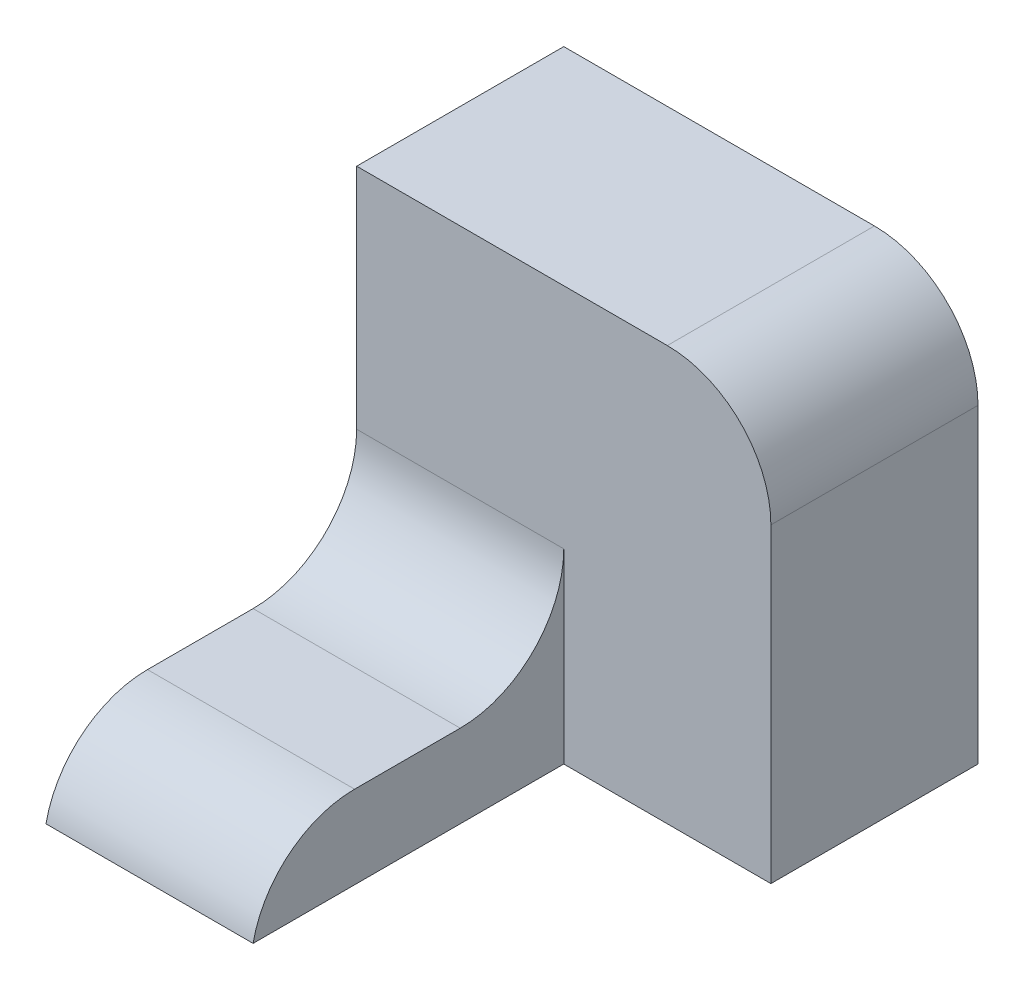
ISO-10303-21;
HEADER;
FILE_DESCRIPTION(('STEP AP214'),'2;1');
FILE_NAME('part.step','',(''),(''),'','','');
FILE_SCHEMA(('AUTOMOTIVE_DESIGN { 1 0 10303 214 1 1 1 1 }'));
ENDSEC;
DATA;
#1=APPLICATION_CONTEXT('core data for automotive mechanical design processes');
#2=APPLICATION_PROTOCOL_DEFINITION('international standard','automotive_design',2000,#1);
#3=PRODUCT_CONTEXT('',#1,'mechanical');
#4=PRODUCT('Part','Part','',(#3));
#5=PRODUCT_RELATED_PRODUCT_CATEGORY('part','',(#4));
#6=PRODUCT_DEFINITION_FORMATION('','',#4);
#7=PRODUCT_DEFINITION_CONTEXT('part definition',#1,'design');
#8=PRODUCT_DEFINITION('design','',#6,#7);
#9=PRODUCT_DEFINITION_SHAPE('','',#8);
#10=(LENGTH_UNIT() NAMED_UNIT(*) SI_UNIT(.MILLI.,.METRE.));
#11=(NAMED_UNIT(*) PLANE_ANGLE_UNIT() SI_UNIT($,.RADIAN.));
#12=(NAMED_UNIT(*) SI_UNIT($,.STERADIAN.) SOLID_ANGLE_UNIT());
#13=UNCERTAINTY_MEASURE_WITH_UNIT(LENGTH_MEASURE(1.E-05),#10,'distance_accuracy_value','');
#14=(GEOMETRIC_REPRESENTATION_CONTEXT(3) GLOBAL_UNCERTAINTY_ASSIGNED_CONTEXT((#13)) GLOBAL_UNIT_ASSIGNED_CONTEXT((#10,
#11,#12)) REPRESENTATION_CONTEXT('',''));
#15=CARTESIAN_POINT('',(0.,0.,0.));
#16=DIRECTION('',(0.,0.,1.));
#17=DIRECTION('',(1.,0.,0.));
#18=AXIS2_PLACEMENT_3D('',#15,#16,#17);
#19=CARTESIAN_POINT('',(-10.,0.,30.));
#20=DIRECTION('',(0.,-1.,0.));
#21=DIRECTION('',(1.,0.,0.));
#22=AXIS2_PLACEMENT_3D('',#19,#20,#21);
#23=PLANE('',#22);
#24=DIRECTION('',(0.,0.,-1.));
#25=VECTOR('',#24,1.);
#26=CARTESIAN_POINT('',(-10.,0.,30.));
#27=LINE('',#26,#25);
#28=CARTESIAN_POINT('',(-10.,0.,20.2020410288673));
#29=VERTEX_POINT('',#28);
#30=CARTESIAN_POINT('',(-10.,0.,10.));
#31=VERTEX_POINT('',#30);
#32=EDGE_CURVE('E144',#29,#31,#27,.T.);
#33=ORIENTED_EDGE('',*,*,#32,.T.);
#34=DIRECTION('',(-1.,0.,0.));
#35=VECTOR('',#34,1.);
#36=CARTESIAN_POINT('',(-10.,0.,10.));
#37=LINE('',#36,#35);
#38=CARTESIAN_POINT('',(-30.,0.,10.));
#39=VERTEX_POINT('',#38);
#40=EDGE_CURVE('E158',#31,#39,#37,.T.);
#41=ORIENTED_EDGE('',*,*,#40,.T.);
#42=DIRECTION('',(0.,0.,-1.));
#43=VECTOR('',#42,1.);
#44=CARTESIAN_POINT('',(-30.,0.,30.));
#45=LINE('',#44,#43);
#46=CARTESIAN_POINT('',(-30.,0.,20.2020410288673));
#47=VERTEX_POINT('',#46);
#48=EDGE_CURVE('E153',#47,#39,#45,.T.);
#49=ORIENTED_EDGE('',*,*,#48,.F.);
#50=DIRECTION('',(-1.,0.,0.));
#51=VECTOR('',#50,1.);
#52=CARTESIAN_POINT('',(-10.,0.,20.2020410288673));
#53=LINE('',#52,#51);
#54=EDGE_CURVE('E156',#47,#29,#53,.F.);
#55=ORIENTED_EDGE('',*,*,#54,.T.);
#56=EDGE_LOOP('',(#33,#41,#49,#55));
#57=FACE_BOUND('',#56,.T.);
#58=ADVANCED_FACE('F35',(#57),#23,.F.);
#59=CARTESIAN_POINT('',(-30.,0.,30.));
#60=DIRECTION('',(1.,0.,0.));
#61=DIRECTION('',(0.,0.,-1.));
#62=AXIS2_PLACEMENT_3D('',#59,#60,#61);
#63=PLANE('',#62);
#64=DIRECTION('',(0.,0.,-1.));
#65=VECTOR('',#64,1.);
#66=CARTESIAN_POINT('',(-30.,-8.,30.));
#67=LINE('',#66,#65);
#68=CARTESIAN_POINT('',(-30.,-8.,30.));
#69=VERTEX_POINT('',#68);
#70=CARTESIAN_POINT('',(-30.,-8.,-20.));
#71=VERTEX_POINT('',#70);
#72=EDGE_CURVE('E151',#69,#71,#67,.T.);
#73=ORIENTED_EDGE('',*,*,#72,.F.);
#74=CARTESIAN_POINT('',(-30.,-10.,20.2020410288673));
#75=DIRECTION('',(1.,0.,0.));
#76=DIRECTION('',(0.,0.,-1.));
#77=AXIS2_PLACEMENT_3D('',#74,#75,#76);
#78=CIRCLE('',#77,10.);
#79=EDGE_CURVE('E171',#69,#47,#78,.F.);
#80=ORIENTED_EDGE('',*,*,#79,.T.);
#81=ORIENTED_EDGE('',*,*,#48,.T.);
#82=CARTESIAN_POINT('',(-30.,10.,10.));
#83=DIRECTION('',(1.,0.,0.));
#84=DIRECTION('',(0.,0.,-1.));
#85=AXIS2_PLACEMENT_3D('',#82,#83,#84);
#86=CIRCLE('',#85,10.);
#87=CARTESIAN_POINT('',(-30.,10.,0.));
#88=VERTEX_POINT('',#87);
#89=EDGE_CURVE('E43',#39,#88,#86,.T.);
#90=ORIENTED_EDGE('',*,*,#89,.T.);
#91=DIRECTION('',(0.,-1.,0.));
#92=VECTOR('',#91,1.);
#93=CARTESIAN_POINT('',(-30.,32.,0.));
#94=LINE('',#93,#92);
#95=CARTESIAN_POINT('',(-30.,32.,0.));
#96=VERTEX_POINT('',#95);
#97=EDGE_CURVE('E119',#96,#88,#94,.T.);
#98=ORIENTED_EDGE('',*,*,#97,.F.);
#99=DIRECTION('',(0.,0.,1.));
#100=VECTOR('',#99,1.);
#101=CARTESIAN_POINT('',(-30.,32.,-20.));
#102=LINE('',#101,#100);
#103=CARTESIAN_POINT('',(-30.,32.,-20.));
#104=VERTEX_POINT('',#103);
#105=EDGE_CURVE('E108',#104,#96,#102,.T.);
#106=ORIENTED_EDGE('',*,*,#105,.F.);
#107=DIRECTION('',(0.,-1.,0.));
#108=VECTOR('',#107,1.);
#109=CARTESIAN_POINT('',(-30.,32.,-20.));
#110=LINE('',#109,#108);
#111=EDGE_CURVE('E111',#104,#71,#110,.T.);
#112=ORIENTED_EDGE('',*,*,#111,.T.);
#113=EDGE_LOOP('',(#73,#80,#81,#90,#98,#106,#112));
#114=FACE_BOUND('',#113,.T.);
#115=ADVANCED_FACE('F117',(#114),#63,.F.);
#116=CARTESIAN_POINT('',(-30.,-8.,30.));
#117=DIRECTION('',(0.,1.,0.));
#118=DIRECTION('',(0.,0.,1.));
#119=AXIS2_PLACEMENT_3D('',#116,#117,#118);
#120=PLANE('',#119);
#121=ORIENTED_EDGE('',*,*,#72,.T.);
#122=DIRECTION('',(1.,0.,0.));
#123=VECTOR('',#122,1.);
#124=CARTESIAN_POINT('',(-30.,-8.,-20.));
#125=LINE('',#124,#123);
#126=CARTESIAN_POINT('',(10.,-8.,-20.));
#127=VERTEX_POINT('',#126);
#128=EDGE_CURVE('E126',#71,#127,#125,.T.);
#129=ORIENTED_EDGE('',*,*,#128,.T.);
#130=DIRECTION('',(0.,0.,1.));
#131=VECTOR('',#130,1.);
#132=CARTESIAN_POINT('',(10.,-8.,-20.));
#133=LINE('',#132,#131);
#134=CARTESIAN_POINT('',(10.,-8.,0.));
#135=VERTEX_POINT('',#134);
#136=EDGE_CURVE('E120',#127,#135,#133,.T.);
#137=ORIENTED_EDGE('',*,*,#136,.T.);
#138=DIRECTION('',(1.,0.,0.));
#139=VECTOR('',#138,1.);
#140=CARTESIAN_POINT('',(-30.,-8.,0.));
#141=LINE('',#140,#139);
#142=CARTESIAN_POINT('',(-10.,-8.,0.));
#143=VERTEX_POINT('',#142);
#144=EDGE_CURVE('E134',#143,#135,#141,.T.);
#145=ORIENTED_EDGE('',*,*,#144,.F.);
#146=DIRECTION('',(0.,0.,-1.));
#147=VECTOR('',#146,1.);
#148=CARTESIAN_POINT('',(-10.,-8.,30.));
#149=LINE('',#148,#147);
#150=CARTESIAN_POINT('',(-10.,-8.,30.));
#151=VERTEX_POINT('',#150);
#152=EDGE_CURVE('E148',#151,#143,#149,.T.);
#153=ORIENTED_EDGE('',*,*,#152,.F.);
#154=DIRECTION('',(1.,0.,0.));
#155=VECTOR('',#154,1.);
#156=CARTESIAN_POINT('',(-30.,-8.,30.));
#157=LINE('',#156,#155);
#158=EDGE_CURVE('E141',#69,#151,#157,.T.);
#159=ORIENTED_EDGE('',*,*,#158,.F.);
#160=EDGE_LOOP('',(#121,#129,#137,#145,#153,#159));
#161=FACE_BOUND('',#160,.T.);
#162=ADVANCED_FACE('F193',(#161),#120,.F.);
#163=CARTESIAN_POINT('',(-10.,-8.,30.));
#164=DIRECTION('',(-1.,0.,0.));
#165=DIRECTION('',(0.,0.,1.));
#166=AXIS2_PLACEMENT_3D('',#163,#164,#165);
#167=PLANE('',#166);
#168=ORIENTED_EDGE('',*,*,#32,.F.);
#169=CARTESIAN_POINT('',(-10.,-10.,20.2020410288673));
#170=DIRECTION('',(-1.,0.,0.));
#171=DIRECTION('',(0.,0.,1.));
#172=AXIS2_PLACEMENT_3D('',#169,#170,#171);
#173=CIRCLE('',#172,10.);
#174=EDGE_CURVE('E173',#29,#151,#173,.F.);
#175=ORIENTED_EDGE('',*,*,#174,.T.);
#176=ORIENTED_EDGE('',*,*,#152,.T.);
#177=DIRECTION('',(0.,1.,0.));
#178=VECTOR('',#177,1.);
#179=CARTESIAN_POINT('',(-10.,-8.,0.));
#180=LINE('',#179,#178);
#181=CARTESIAN_POINT('',(-10.,10.,0.));
#182=VERTEX_POINT('',#181);
#183=EDGE_CURVE('E139',#143,#182,#180,.T.);
#184=ORIENTED_EDGE('',*,*,#183,.T.);
#185=CARTESIAN_POINT('',(-10.,10.,10.));
#186=DIRECTION('',(-1.,0.,0.));
#187=DIRECTION('',(0.,0.,1.));
#188=AXIS2_PLACEMENT_3D('',#185,#186,#187);
#189=CIRCLE('',#188,10.);
#190=EDGE_CURVE('E11',#182,#31,#189,.T.);
#191=ORIENTED_EDGE('',*,*,#190,.T.);
#192=EDGE_LOOP('',(#168,#175,#176,#184,#191));
#193=FACE_BOUND('',#192,.T.);
#194=ADVANCED_FACE('F184',(#193),#167,.F.);
#195=CARTESIAN_POINT('',(0.,0.,0.));
#196=DIRECTION('',(0.,0.,1.));
#197=DIRECTION('',(1.,0.,0.));
#198=AXIS2_PLACEMENT_3D('',#195,#196,#197);
#199=PLANE('',#198);
#200=ORIENTED_EDGE('',*,*,#97,.T.);
#201=DIRECTION('',(-1.,0.,0.));
#202=VECTOR('',#201,1.);
#203=CARTESIAN_POINT('',(0.,10.,0.));
#204=LINE('',#203,#202);
#205=EDGE_CURVE('E163',#88,#182,#204,.F.);
#206=ORIENTED_EDGE('',*,*,#205,.T.);
#207=ORIENTED_EDGE('',*,*,#183,.F.);
#208=ORIENTED_EDGE('',*,*,#144,.T.);
#209=DIRECTION('',(0.,1.,0.));
#210=VECTOR('',#209,1.);
#211=CARTESIAN_POINT('',(10.,-8.,0.));
#212=LINE('',#211,#210);
#213=CARTESIAN_POINT('',(10.,22.,0.));
#214=VERTEX_POINT('',#213);
#215=EDGE_CURVE('E112',#135,#214,#212,.T.);
#216=ORIENTED_EDGE('',*,*,#215,.T.);
#217=CARTESIAN_POINT('',(0.,22.,0.));
#218=DIRECTION('',(0.,0.,1.));
#219=DIRECTION('',(1.,0.,0.));
#220=AXIS2_PLACEMENT_3D('',#217,#218,#219);
#221=CIRCLE('',#220,10.);
#222=CARTESIAN_POINT('',(0.,32.,0.));
#223=VERTEX_POINT('',#222);
#224=EDGE_CURVE('E161',#214,#223,#221,.T.);
#225=ORIENTED_EDGE('',*,*,#224,.T.);
#226=DIRECTION('',(-1.,0.,0.));
#227=VECTOR('',#226,1.);
#228=CARTESIAN_POINT('',(10.,32.,0.));
#229=LINE('',#228,#227);
#230=EDGE_CURVE('E131',#223,#96,#229,.T.);
#231=ORIENTED_EDGE('',*,*,#230,.T.);
#232=EDGE_LOOP('',(#200,#206,#207,#208,#216,#225,#231));
#233=FACE_BOUND('',#232,.T.);
#234=ADVANCED_FACE('F179',(#233),#199,.T.);
#235=CARTESIAN_POINT('',(10.,32.,-20.));
#236=DIRECTION('',(0.,1.,0.));
#237=DIRECTION('',(-1.,0.,0.));
#238=AXIS2_PLACEMENT_3D('',#235,#236,#237);
#239=PLANE('',#238);
#240=ORIENTED_EDGE('',*,*,#230,.F.);
#241=DIRECTION('',(0.,0.,1.));
#242=VECTOR('',#241,1.);
#243=CARTESIAN_POINT('',(0.,32.,-20.));
#244=LINE('',#243,#242);
#245=CARTESIAN_POINT('',(0.,32.,-20.));
#246=VERTEX_POINT('',#245);
#247=EDGE_CURVE('E50',#223,#246,#244,.F.);
#248=ORIENTED_EDGE('',*,*,#247,.T.);
#249=DIRECTION('',(-1.,0.,0.));
#250=VECTOR('',#249,1.);
#251=CARTESIAN_POINT('',(10.,32.,-20.));
#252=LINE('',#251,#250);
#253=EDGE_CURVE('E105',#246,#104,#252,.T.);
#254=ORIENTED_EDGE('',*,*,#253,.T.);
#255=ORIENTED_EDGE('',*,*,#105,.T.);
#256=EDGE_LOOP('',(#240,#248,#254,#255));
#257=FACE_BOUND('',#256,.T.);
#258=ADVANCED_FACE('F107',(#257),#239,.T.);
#259=CARTESIAN_POINT('',(10.,-8.,-20.));
#260=DIRECTION('',(1.,0.,0.));
#261=DIRECTION('',(0.,0.,-1.));
#262=AXIS2_PLACEMENT_3D('',#259,#260,#261);
#263=PLANE('',#262);
#264=DIRECTION('',(0.,1.,0.));
#265=VECTOR('',#264,1.);
#266=CARTESIAN_POINT('',(10.,-8.,-20.));
#267=LINE('',#266,#265);
#268=CARTESIAN_POINT('',(10.,22.,-20.));
#269=VERTEX_POINT('',#268);
#270=EDGE_CURVE('E121',#127,#269,#267,.T.);
#271=ORIENTED_EDGE('',*,*,#270,.T.);
#272=DIRECTION('',(0.,0.,1.));
#273=VECTOR('',#272,1.);
#274=CARTESIAN_POINT('',(10.,22.,-20.));
#275=LINE('',#274,#273);
#276=EDGE_CURVE('E166',#269,#214,#275,.T.);
#277=ORIENTED_EDGE('',*,*,#276,.T.);
#278=ORIENTED_EDGE('',*,*,#215,.F.);
#279=ORIENTED_EDGE('',*,*,#136,.F.);
#280=EDGE_LOOP('',(#271,#277,#278,#279));
#281=FACE_BOUND('',#280,.T.);
#282=ADVANCED_FACE('F196',(#281),#263,.T.);
#283=CARTESIAN_POINT('',(0.,0.,-20.));
#284=DIRECTION('',(0.,0.,1.));
#285=DIRECTION('',(1.,0.,0.));
#286=AXIS2_PLACEMENT_3D('',#283,#284,#285);
#287=PLANE('',#286);
#288=ORIENTED_EDGE('',*,*,#253,.F.);
#289=CARTESIAN_POINT('',(0.,22.,-20.));
#290=DIRECTION('',(0.,0.,1.));
#291=DIRECTION('',(1.,0.,0.));
#292=AXIS2_PLACEMENT_3D('',#289,#290,#291);
#293=CIRCLE('',#292,10.);
#294=EDGE_CURVE('E57',#246,#269,#293,.F.);
#295=ORIENTED_EDGE('',*,*,#294,.T.);
#296=ORIENTED_EDGE('',*,*,#270,.F.);
#297=ORIENTED_EDGE('',*,*,#128,.F.);
#298=ORIENTED_EDGE('',*,*,#111,.F.);
#299=EDGE_LOOP('',(#288,#295,#296,#297,#298));
#300=FACE_BOUND('',#299,.T.);
#301=ADVANCED_FACE('F124',(#300),#287,.F.);
#302=CARTESIAN_POINT('',(-10.,10.,10.));
#303=DIRECTION('',(-1.,0.,0.));
#304=DIRECTION('',(0.,-1.,0.));
#305=AXIS2_PLACEMENT_3D('',#302,#303,#304);
#306=CYLINDRICAL_SURFACE('',#305,10.);
#307=ORIENTED_EDGE('',*,*,#190,.F.);
#308=ORIENTED_EDGE('',*,*,#205,.F.);
#309=ORIENTED_EDGE('',*,*,#89,.F.);
#310=ORIENTED_EDGE('',*,*,#40,.F.);
#311=EDGE_LOOP('',(#307,#308,#309,#310));
#312=FACE_BOUND('',#311,.T.);
#313=ADVANCED_FACE('F181',(#312),#306,.F.);
#314=CARTESIAN_POINT('',(0.,22.,-20.));
#315=DIRECTION('',(0.,0.,1.));
#316=DIRECTION('',(1.,0.,0.));
#317=AXIS2_PLACEMENT_3D('',#314,#315,#316);
#318=CYLINDRICAL_SURFACE('',#317,10.);
#319=ORIENTED_EDGE('',*,*,#294,.F.);
#320=ORIENTED_EDGE('',*,*,#247,.F.);
#321=ORIENTED_EDGE('',*,*,#224,.F.);
#322=ORIENTED_EDGE('',*,*,#276,.F.);
#323=EDGE_LOOP('',(#319,#320,#321,#322));
#324=FACE_BOUND('',#323,.T.);
#325=ADVANCED_FACE('F199',(#324),#318,.T.);
#326=CARTESIAN_POINT('',(0.,-10.,20.2020410288673));
#327=DIRECTION('',(-1.,0.,0.));
#328=DIRECTION('',(0.,0.,1.));
#329=AXIS2_PLACEMENT_3D('',#326,#327,#328);
#330=CYLINDRICAL_SURFACE('',#329,10.);
#331=ORIENTED_EDGE('',*,*,#174,.F.);
#332=ORIENTED_EDGE('',*,*,#54,.F.);
#333=ORIENTED_EDGE('',*,*,#79,.F.);
#334=ORIENTED_EDGE('',*,*,#158,.T.);
#335=EDGE_LOOP('',(#331,#332,#333,#334));
#336=FACE_BOUND('',#335,.T.);
#337=ADVANCED_FACE('F37',(#336),#330,.T.);
#338=CLOSED_SHELL('',(#58,#115,#162,#194,#234,#258,#282,#301,#313,#325,#337));
#339=MANIFOLD_SOLID_BREP('B2',#338);
#340=ADVANCED_BREP_SHAPE_REPRESENTATION('',(#18,#339),#14);
#341=SHAPE_DEFINITION_REPRESENTATION(#9,#340);
ENDSEC;
END-ISO-10303-21;
